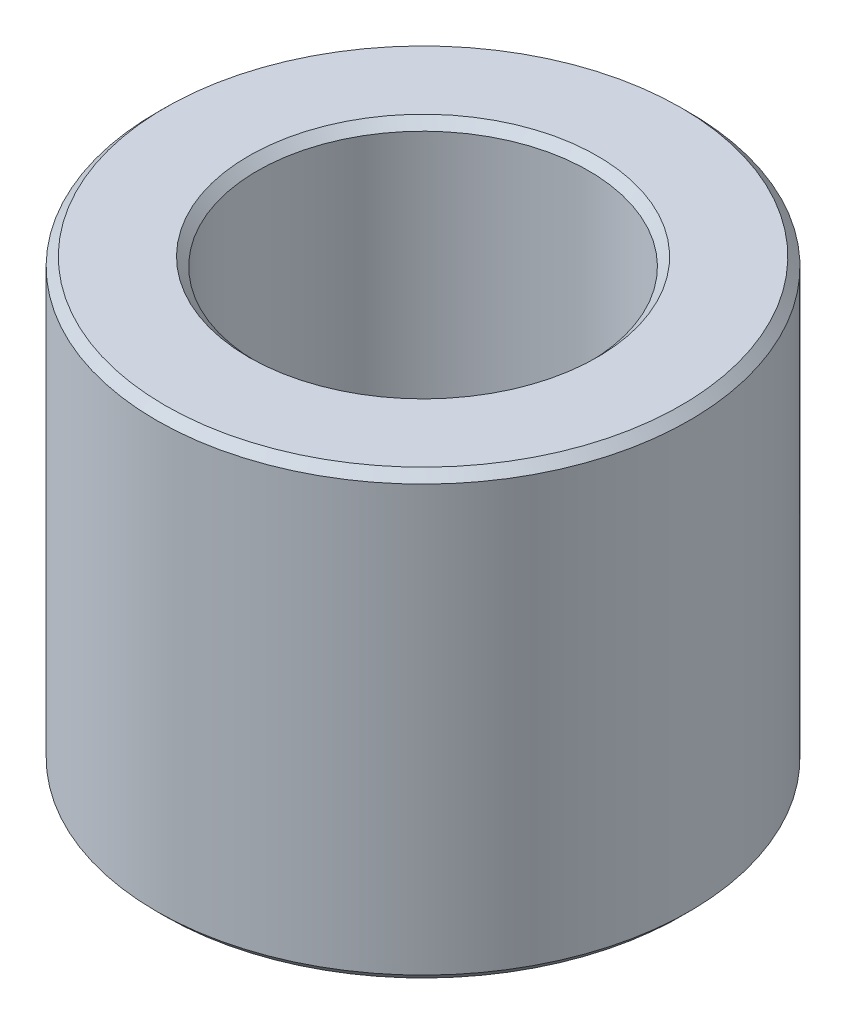
ISO-10303-21;
HEADER;
FILE_DESCRIPTION(('STEP AP214'),'2;1');
FILE_NAME('part.step','',(''),(''),'','','');
FILE_SCHEMA(('AUTOMOTIVE_DESIGN { 1 0 10303 214 1 1 1 1 }'));
ENDSEC;
DATA;
#1=APPLICATION_CONTEXT('core data for automotive mechanical design processes');
#2=APPLICATION_PROTOCOL_DEFINITION('international standard','automotive_design',2000,#1);
#3=PRODUCT_CONTEXT('',#1,'mechanical');
#4=PRODUCT('Part','Part','',(#3));
#5=PRODUCT_RELATED_PRODUCT_CATEGORY('part','',(#4));
#6=PRODUCT_DEFINITION_FORMATION('','',#4);
#7=PRODUCT_DEFINITION_CONTEXT('part definition',#1,'design');
#8=PRODUCT_DEFINITION('design','',#6,#7);
#9=PRODUCT_DEFINITION_SHAPE('','',#8);
#10=(LENGTH_UNIT() NAMED_UNIT(*) SI_UNIT(.MILLI.,.METRE.));
#11=(NAMED_UNIT(*) PLANE_ANGLE_UNIT() SI_UNIT($,.RADIAN.));
#12=(NAMED_UNIT(*) SI_UNIT($,.STERADIAN.) SOLID_ANGLE_UNIT());
#13=UNCERTAINTY_MEASURE_WITH_UNIT(LENGTH_MEASURE(1.E-05),#10,'distance_accuracy_value','');
#14=(GEOMETRIC_REPRESENTATION_CONTEXT(3) GLOBAL_UNCERTAINTY_ASSIGNED_CONTEXT((#13)) GLOBAL_UNIT_ASSIGNED_CONTEXT((#10,
#11,#12)) REPRESENTATION_CONTEXT('',''));
#15=CARTESIAN_POINT('',(0.,0.,0.));
#16=DIRECTION('',(0.,0.,1.));
#17=DIRECTION('',(1.,0.,0.));
#18=AXIS2_PLACEMENT_3D('',#15,#16,#17);
#19=CARTESIAN_POINT('',(0.,58.094792606373,0.));
#20=DIRECTION('',(0.,-1.,0.));
#21=DIRECTION('',(0.,0.,-1.));
#22=AXIS2_PLACEMENT_3D('',#19,#20,#21);
#23=CYLINDRICAL_SURFACE('',#22,35.);
#24=CARTESIAN_POINT('',(0.,1.13055943275923,0.));
#25=DIRECTION('',(0.,1.,0.));
#26=DIRECTION('',(0.,0.,1.));
#27=AXIS2_PLACEMENT_3D('',#24,#25,#26);
#28=CIRCLE('',#27,35.);
#29=CARTESIAN_POINT('',(0.,1.13055943275923,35.));
#30=VERTEX_POINT('',#29);
#31=EDGE_CURVE('E10',#30,#30,#28,.T.);
#32=ORIENTED_EDGE('',*,*,#31,.T.);
#33=EDGE_LOOP('',(#32));
#34=FACE_BOUND('',#33,.T.);
#35=CARTESIAN_POINT('',(0.,56.9642331736138,0.));
#36=DIRECTION('',(0.,1.,0.));
#37=DIRECTION('',(0.,0.,1.));
#38=AXIS2_PLACEMENT_3D('',#35,#36,#37);
#39=CIRCLE('',#38,35.);
#40=CARTESIAN_POINT('',(0.,56.9642331736138,35.));
#41=VERTEX_POINT('',#40);
#42=EDGE_CURVE('E50',#41,#41,#39,.F.);
#43=ORIENTED_EDGE('',*,*,#42,.T.);
#44=EDGE_LOOP('',(#43));
#45=FACE_BOUND('',#44,.T.);
#46=ADVANCED_FACE('F39',(#34,#45),#23,.T.);
#47=CARTESIAN_POINT('',(0.,58.094792606373,0.));
#48=DIRECTION('',(0.,1.,0.));
#49=DIRECTION('',(0.,0.,1.));
#50=AXIS2_PLACEMENT_3D('',#47,#48,#49);
#51=PLANE('',#50);
#52=CARTESIAN_POINT('',(0.,58.094792606373,0.));
#53=DIRECTION('',(0.,1.,0.));
#54=DIRECTION('',(0.,0.,1.));
#55=AXIS2_PLACEMENT_3D('',#52,#53,#54);
#56=CIRCLE('',#55,22.8947181598898);
#57=CARTESIAN_POINT('',(0.,58.094792606373,22.8947181598898));
#58=VERTEX_POINT('',#57);
#59=EDGE_CURVE('E58',#58,#58,#56,.F.);
#60=ORIENTED_EDGE('',*,*,#59,.T.);
#61=EDGE_LOOP('',(#60));
#62=FACE_BOUND('',#61,.T.);
#63=CARTESIAN_POINT('',(0.,58.094792606373,0.));
#64=DIRECTION('',(0.,1.,0.));
#65=DIRECTION('',(0.,0.,1.));
#66=AXIS2_PLACEMENT_3D('',#63,#64,#65);
#67=CIRCLE('',#66,33.8694405672408);
#68=CARTESIAN_POINT('',(0.,58.094792606373,33.8694405672408));
#69=VERTEX_POINT('',#68);
#70=EDGE_CURVE('E61',#69,#69,#67,.T.);
#71=ORIENTED_EDGE('',*,*,#70,.T.);
#72=EDGE_LOOP('',(#71));
#73=FACE_BOUND('',#72,.T.);
#74=ADVANCED_FACE('F88',(#62,#73),#51,.T.);
#75=CARTESIAN_POINT('',(0.,0.,0.));
#76=DIRECTION('',(0.,1.,0.));
#77=DIRECTION('',(0.,0.,1.));
#78=AXIS2_PLACEMENT_3D('',#75,#76,#77);
#79=PLANE('',#78);
#80=CARTESIAN_POINT('',(0.,0.,0.));
#81=DIRECTION('',(0.,1.,0.));
#82=DIRECTION('',(0.,0.,1.));
#83=AXIS2_PLACEMENT_3D('',#80,#81,#82);
#84=CIRCLE('',#83,22.8947181598898);
#85=CARTESIAN_POINT('',(0.,0.,22.8947181598898));
#86=VERTEX_POINT('',#85);
#87=EDGE_CURVE('E51',#86,#86,#84,.T.);
#88=ORIENTED_EDGE('',*,*,#87,.T.);
#89=EDGE_LOOP('',(#88));
#90=FACE_BOUND('',#89,.T.);
#91=CARTESIAN_POINT('',(0.,0.,0.));
#92=DIRECTION('',(0.,1.,0.));
#93=DIRECTION('',(0.,0.,1.));
#94=AXIS2_PLACEMENT_3D('',#91,#92,#93);
#95=CIRCLE('',#94,33.8694405672408);
#96=CARTESIAN_POINT('',(0.,0.,33.8694405672408));
#97=VERTEX_POINT('',#96);
#98=EDGE_CURVE('E54',#97,#97,#95,.F.);
#99=ORIENTED_EDGE('',*,*,#98,.T.);
#100=EDGE_LOOP('',(#99));
#101=FACE_BOUND('',#100,.T.);
#102=ADVANCED_FACE('F83',(#90,#101),#79,.F.);
#103=CARTESIAN_POINT('',(0.,58.094792606373,0.));
#104=DIRECTION('',(0.,-1.,0.));
#105=DIRECTION('',(0.,0.,-1.));
#106=AXIS2_PLACEMENT_3D('',#103,#104,#105);
#107=CYLINDRICAL_SURFACE('',#106,21.7641587271306);
#108=CARTESIAN_POINT('',(0.,56.9642331736138,0.));
#109=DIRECTION('',(0.,1.,0.));
#110=DIRECTION('',(0.,0.,1.));
#111=AXIS2_PLACEMENT_3D('',#108,#109,#110);
#112=CIRCLE('',#111,21.7641587271306);
#113=CARTESIAN_POINT('',(0.,56.9642331736138,21.7641587271306));
#114=VERTEX_POINT('',#113);
#115=EDGE_CURVE('E67',#114,#114,#112,.T.);
#116=ORIENTED_EDGE('',*,*,#115,.T.);
#117=EDGE_LOOP('',(#116));
#118=FACE_BOUND('',#117,.T.);
#119=CARTESIAN_POINT('',(0.,1.13055943275925,0.));
#120=DIRECTION('',(0.,1.,0.));
#121=DIRECTION('',(0.,0.,1.));
#122=AXIS2_PLACEMENT_3D('',#119,#120,#121);
#123=CIRCLE('',#122,21.7641587271306);
#124=CARTESIAN_POINT('',(0.,1.13055943275925,21.7641587271306));
#125=VERTEX_POINT('',#124);
#126=EDGE_CURVE('E69',#125,#125,#123,.F.);
#127=ORIENTED_EDGE('',*,*,#126,.T.);
#128=EDGE_LOOP('',(#127));
#129=FACE_BOUND('',#128,.T.);
#130=ADVANCED_FACE('F71',(#118,#129),#107,.F.);
#131=CARTESIAN_POINT('',(0.,56.9642331736138,0.));
#132=DIRECTION('',(0.,1.,0.));
#133=DIRECTION('',(0.,0.,1.));
#134=AXIS2_PLACEMENT_3D('',#131,#132,#133);
#135=CONICAL_SURFACE('',#134,21.7641587271306,0.785398163397451);
#136=ORIENTED_EDGE('',*,*,#59,.F.);
#137=EDGE_LOOP('',(#136));
#138=FACE_BOUND('',#137,.T.);
#139=ORIENTED_EDGE('',*,*,#115,.F.);
#140=EDGE_LOOP('',(#139));
#141=FACE_BOUND('',#140,.T.);
#142=ADVANCED_FACE('F77',(#138,#141),#135,.F.);
#143=CARTESIAN_POINT('',(0.,0.,0.));
#144=DIRECTION('',(0.,-1.,0.));
#145=DIRECTION('',(0.,0.,-1.));
#146=AXIS2_PLACEMENT_3D('',#143,#144,#145);
#147=CONICAL_SURFACE('',#146,22.8947181598898,0.785398163397445);
#148=ORIENTED_EDGE('',*,*,#126,.F.);
#149=EDGE_LOOP('',(#148));
#150=FACE_BOUND('',#149,.T.);
#151=ORIENTED_EDGE('',*,*,#87,.F.);
#152=EDGE_LOOP('',(#151));
#153=FACE_BOUND('',#152,.T.);
#154=ADVANCED_FACE('F73',(#150,#153),#147,.F.);
#155=CARTESIAN_POINT('',(0.,1.13055943275923,0.));
#156=DIRECTION('',(0.,1.,0.));
#157=DIRECTION('',(0.,0.,1.));
#158=AXIS2_PLACEMENT_3D('',#155,#156,#157);
#159=CONICAL_SURFACE('',#158,35.,0.785398163397448);
#160=ORIENTED_EDGE('',*,*,#98,.F.);
#161=EDGE_LOOP('',(#160));
#162=FACE_BOUND('',#161,.T.);
#163=ORIENTED_EDGE('',*,*,#31,.F.);
#164=EDGE_LOOP('',(#163));
#165=FACE_BOUND('',#164,.T.);
#166=ADVANCED_FACE('F76',(#162,#165),#159,.T.);
#167=CARTESIAN_POINT('',(0.,58.094792606373,0.));
#168=DIRECTION('',(0.,-1.,0.));
#169=DIRECTION('',(0.,0.,-1.));
#170=AXIS2_PLACEMENT_3D('',#167,#168,#169);
#171=CONICAL_SURFACE('',#170,33.8694405672408,0.785398163397448);
#172=ORIENTED_EDGE('',*,*,#42,.F.);
#173=EDGE_LOOP('',(#172));
#174=FACE_BOUND('',#173,.T.);
#175=ORIENTED_EDGE('',*,*,#70,.F.);
#176=EDGE_LOOP('',(#175));
#177=FACE_BOUND('',#176,.T.);
#178=ADVANCED_FACE('F45',(#174,#177),#171,.T.);
#179=CLOSED_SHELL('',(#46,#74,#102,#130,#142,#154,#166,#178));
#180=MANIFOLD_SOLID_BREP('B2',#179);
#181=ADVANCED_BREP_SHAPE_REPRESENTATION('',(#18,#180),#14);
#182=SHAPE_DEFINITION_REPRESENTATION(#9,#181);
ENDSEC;
END-ISO-10303-21;
